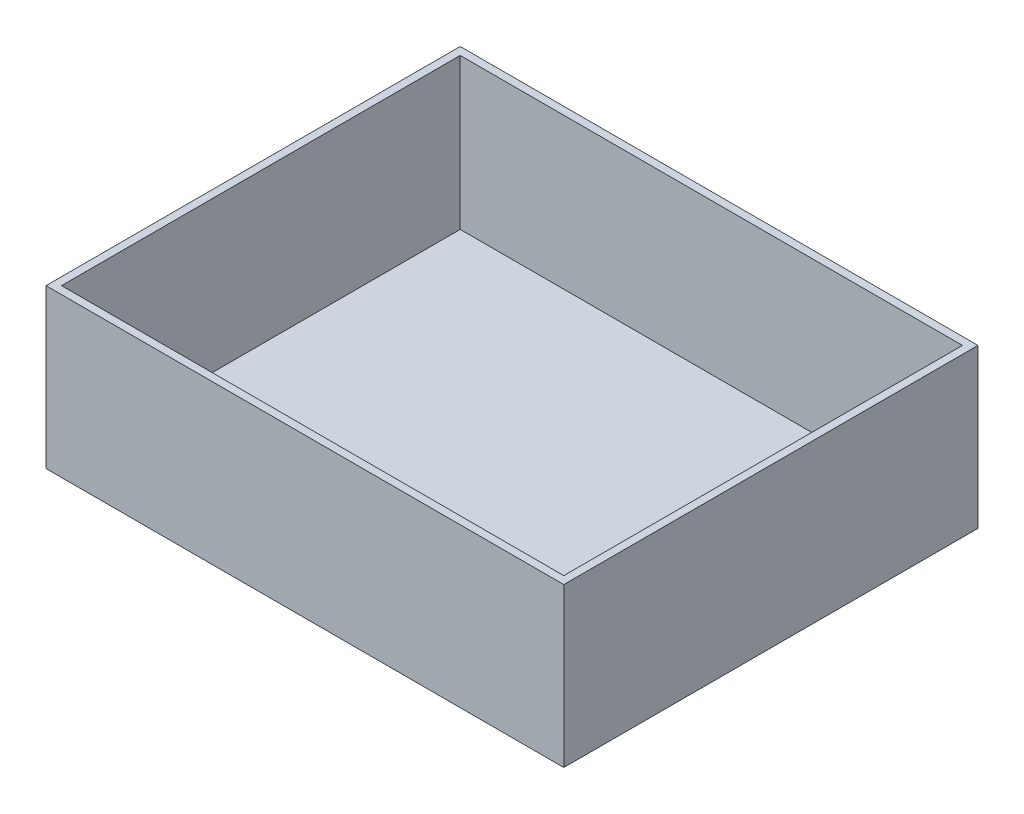
ISO-10303-21;
HEADER;
FILE_DESCRIPTION(('STEP AP214'),'2;1');
FILE_NAME('part.step','',(''),(''),'','','');
FILE_SCHEMA(('AUTOMOTIVE_DESIGN { 1 0 10303 214 1 1 1 1 }'));
ENDSEC;
DATA;
#1=APPLICATION_CONTEXT('core data for automotive mechanical design processes');
#2=APPLICATION_PROTOCOL_DEFINITION('international standard','automotive_design',2000,#1);
#3=PRODUCT_CONTEXT('',#1,'mechanical');
#4=PRODUCT('Part','Part','',(#3));
#5=PRODUCT_RELATED_PRODUCT_CATEGORY('part','',(#4));
#6=PRODUCT_DEFINITION_FORMATION('','',#4);
#7=PRODUCT_DEFINITION_CONTEXT('part definition',#1,'design');
#8=PRODUCT_DEFINITION('design','',#6,#7);
#9=PRODUCT_DEFINITION_SHAPE('','',#8);
#10=(LENGTH_UNIT() NAMED_UNIT(*) SI_UNIT(.MILLI.,.METRE.));
#11=(NAMED_UNIT(*) PLANE_ANGLE_UNIT() SI_UNIT($,.RADIAN.));
#12=(NAMED_UNIT(*) SI_UNIT($,.STERADIAN.) SOLID_ANGLE_UNIT());
#13=UNCERTAINTY_MEASURE_WITH_UNIT(LENGTH_MEASURE(1.E-05),#10,'distance_accuracy_value','');
#14=(GEOMETRIC_REPRESENTATION_CONTEXT(3) GLOBAL_UNCERTAINTY_ASSIGNED_CONTEXT((#13)) GLOBAL_UNIT_ASSIGNED_CONTEXT((#10,
#11,#12)) REPRESENTATION_CONTEXT('',''));
#15=CARTESIAN_POINT('',(0.,0.,0.));
#16=DIRECTION('',(0.,0.,1.));
#17=DIRECTION('',(1.,0.,0.));
#18=AXIS2_PLACEMENT_3D('',#15,#16,#17);
#19=CARTESIAN_POINT('',(250.,153.,-200.));
#20=DIRECTION('',(-1.,0.,0.));
#21=DIRECTION('',(0.,0.,1.));
#22=AXIS2_PLACEMENT_3D('',#19,#20,#21);
#23=PLANE('',#22);
#24=DIRECTION('',(0.,0.,-1.));
#25=VECTOR('',#24,1.);
#26=CARTESIAN_POINT('',(250.,0.,-200.));
#27=LINE('',#26,#25);
#28=CARTESIAN_POINT('',(250.,0.,200.));
#29=VERTEX_POINT('',#28);
#30=CARTESIAN_POINT('',(250.,0.,-200.));
#31=VERTEX_POINT('',#30);
#32=EDGE_CURVE('E167',#29,#31,#27,.T.);
#33=ORIENTED_EDGE('',*,*,#32,.T.);
#34=DIRECTION('',(0.,-1.,0.));
#35=VECTOR('',#34,1.);
#36=CARTESIAN_POINT('',(250.,153.,-200.));
#37=LINE('',#36,#35);
#38=CARTESIAN_POINT('',(250.,153.,-200.));
#39=VERTEX_POINT('',#38);
#40=EDGE_CURVE('E11',#39,#31,#37,.T.);
#41=ORIENTED_EDGE('',*,*,#40,.F.);
#42=DIRECTION('',(0.,0.,-1.));
#43=VECTOR('',#42,1.);
#44=CARTESIAN_POINT('',(250.,153.,-200.));
#45=LINE('',#44,#43);
#46=CARTESIAN_POINT('',(250.,153.,200.));
#47=VERTEX_POINT('',#46);
#48=EDGE_CURVE('E156',#47,#39,#45,.T.);
#49=ORIENTED_EDGE('',*,*,#48,.F.);
#50=DIRECTION('',(0.,-1.,0.));
#51=VECTOR('',#50,1.);
#52=CARTESIAN_POINT('',(250.,153.,200.));
#53=LINE('',#52,#51);
#54=EDGE_CURVE('E166',#47,#29,#53,.T.);
#55=ORIENTED_EDGE('',*,*,#54,.T.);
#56=EDGE_LOOP('',(#33,#41,#49,#55));
#57=FACE_BOUND('',#56,.T.);
#58=ADVANCED_FACE('F39',(#57),#23,.F.);
#59=CARTESIAN_POINT('',(-250.,153.,-200.));
#60=DIRECTION('',(0.,0.,1.));
#61=DIRECTION('',(1.,0.,0.));
#62=AXIS2_PLACEMENT_3D('',#59,#60,#61);
#63=PLANE('',#62);
#64=DIRECTION('',(-1.,0.,0.));
#65=VECTOR('',#64,1.);
#66=CARTESIAN_POINT('',(-250.,0.,-200.));
#67=LINE('',#66,#65);
#68=CARTESIAN_POINT('',(-250.,0.,-200.));
#69=VERTEX_POINT('',#68);
#70=EDGE_CURVE('E171',#31,#69,#67,.T.);
#71=ORIENTED_EDGE('',*,*,#70,.T.);
#72=DIRECTION('',(0.,-1.,0.));
#73=VECTOR('',#72,1.);
#74=CARTESIAN_POINT('',(-250.,153.,-200.));
#75=LINE('',#74,#73);
#76=CARTESIAN_POINT('',(-250.,153.,-200.));
#77=VERTEX_POINT('',#76);
#78=EDGE_CURVE('E47',#77,#69,#75,.T.);
#79=ORIENTED_EDGE('',*,*,#78,.F.);
#80=DIRECTION('',(-1.,0.,0.));
#81=VECTOR('',#80,1.);
#82=CARTESIAN_POINT('',(-250.,153.,-200.));
#83=LINE('',#82,#81);
#84=EDGE_CURVE('E91',#39,#77,#83,.T.);
#85=ORIENTED_EDGE('',*,*,#84,.F.);
#86=ORIENTED_EDGE('',*,*,#40,.T.);
#87=EDGE_LOOP('',(#71,#79,#85,#86));
#88=FACE_BOUND('',#87,.T.);
#89=ADVANCED_FACE('F206',(#88),#63,.F.);
#90=CARTESIAN_POINT('',(-250.,153.,-200.));
#91=DIRECTION('',(1.,0.,0.));
#92=DIRECTION('',(0.,0.,-1.));
#93=AXIS2_PLACEMENT_3D('',#90,#91,#92);
#94=PLANE('',#93);
#95=DIRECTION('',(0.,0.,1.));
#96=VECTOR('',#95,1.);
#97=CARTESIAN_POINT('',(-250.,0.,-200.));
#98=LINE('',#97,#96);
#99=CARTESIAN_POINT('',(-250.,0.,200.));
#100=VERTEX_POINT('',#99);
#101=EDGE_CURVE('E174',#69,#100,#98,.T.);
#102=ORIENTED_EDGE('',*,*,#101,.T.);
#103=DIRECTION('',(0.,-1.,0.));
#104=VECTOR('',#103,1.);
#105=CARTESIAN_POINT('',(-250.,153.,200.));
#106=LINE('',#105,#104);
#107=CARTESIAN_POINT('',(-250.,153.,200.));
#108=VERTEX_POINT('',#107);
#109=EDGE_CURVE('E181',#108,#100,#106,.T.);
#110=ORIENTED_EDGE('',*,*,#109,.F.);
#111=DIRECTION('',(0.,0.,1.));
#112=VECTOR('',#111,1.);
#113=CARTESIAN_POINT('',(-250.,153.,-200.));
#114=LINE('',#113,#112);
#115=EDGE_CURVE('E161',#77,#108,#114,.T.);
#116=ORIENTED_EDGE('',*,*,#115,.F.);
#117=ORIENTED_EDGE('',*,*,#78,.T.);
#118=EDGE_LOOP('',(#102,#110,#116,#117));
#119=FACE_BOUND('',#118,.T.);
#120=ADVANCED_FACE('F188',(#119),#94,.F.);
#121=CARTESIAN_POINT('',(-250.,153.,200.));
#122=DIRECTION('',(0.,0.,-1.));
#123=DIRECTION('',(-1.,0.,0.));
#124=AXIS2_PLACEMENT_3D('',#121,#122,#123);
#125=PLANE('',#124);
#126=DIRECTION('',(1.,0.,0.));
#127=VECTOR('',#126,1.);
#128=CARTESIAN_POINT('',(-250.,0.,200.));
#129=LINE('',#128,#127);
#130=EDGE_CURVE('E84',#100,#29,#129,.T.);
#131=ORIENTED_EDGE('',*,*,#130,.T.);
#132=ORIENTED_EDGE('',*,*,#54,.F.);
#133=DIRECTION('',(1.,0.,0.));
#134=VECTOR('',#133,1.);
#135=CARTESIAN_POINT('',(-250.,153.,200.));
#136=LINE('',#135,#134);
#137=EDGE_CURVE('E63',#108,#47,#136,.T.);
#138=ORIENTED_EDGE('',*,*,#137,.F.);
#139=ORIENTED_EDGE('',*,*,#109,.T.);
#140=EDGE_LOOP('',(#131,#132,#138,#139));
#141=FACE_BOUND('',#140,.T.);
#142=ADVANCED_FACE('F196',(#141),#125,.F.);
#143=CARTESIAN_POINT('',(0.,153.,0.));
#144=DIRECTION('',(0.,1.,0.));
#145=DIRECTION('',(0.,0.,1.));
#146=AXIS2_PLACEMENT_3D('',#143,#144,#145);
#147=PLANE('',#146);
#148=DIRECTION('',(0.,0.,-1.));
#149=VECTOR('',#148,1.);
#150=CARTESIAN_POINT('',(242.5,153.,-200.));
#151=LINE('',#150,#149);
#152=CARTESIAN_POINT('',(242.5,153.,192.5));
#153=VERTEX_POINT('',#152);
#154=CARTESIAN_POINT('',(242.5,153.,-192.5));
#155=VERTEX_POINT('',#154);
#156=EDGE_CURVE('E140',#153,#155,#151,.T.);
#157=ORIENTED_EDGE('',*,*,#156,.F.);
#158=DIRECTION('',(1.,0.,0.));
#159=VECTOR('',#158,1.);
#160=CARTESIAN_POINT('',(-250.,153.,192.5));
#161=LINE('',#160,#159);
#162=CARTESIAN_POINT('',(-242.5,153.,192.5));
#163=VERTEX_POINT('',#162);
#164=EDGE_CURVE('E153',#163,#153,#161,.T.);
#165=ORIENTED_EDGE('',*,*,#164,.F.);
#166=DIRECTION('',(0.,0.,1.));
#167=VECTOR('',#166,1.);
#168=CARTESIAN_POINT('',(-242.5,153.,-200.));
#169=LINE('',#168,#167);
#170=CARTESIAN_POINT('',(-242.5,153.,-192.5));
#171=VERTEX_POINT('',#170);
#172=EDGE_CURVE('E150',#171,#163,#169,.T.);
#173=ORIENTED_EDGE('',*,*,#172,.F.);
#174=DIRECTION('',(-1.,0.,0.));
#175=VECTOR('',#174,1.);
#176=CARTESIAN_POINT('',(-250.,153.,-192.5));
#177=LINE('',#176,#175);
#178=EDGE_CURVE('E129',#155,#171,#177,.T.);
#179=ORIENTED_EDGE('',*,*,#178,.F.);
#180=EDGE_LOOP('',(#157,#165,#173,#179));
#181=FACE_BOUND('',#180,.T.);
#182=ORIENTED_EDGE('',*,*,#48,.T.);
#183=ORIENTED_EDGE('',*,*,#84,.T.);
#184=ORIENTED_EDGE('',*,*,#115,.T.);
#185=ORIENTED_EDGE('',*,*,#137,.T.);
#186=EDGE_LOOP('',(#182,#183,#184,#185));
#187=FACE_BOUND('',#186,.T.);
#188=ADVANCED_FACE('F198',(#181,#187),#147,.T.);
#189=CARTESIAN_POINT('',(0.,0.,0.));
#190=DIRECTION('',(0.,1.,0.));
#191=DIRECTION('',(0.,0.,1.));
#192=AXIS2_PLACEMENT_3D('',#189,#190,#191);
#193=PLANE('',#192);
#194=ORIENTED_EDGE('',*,*,#32,.F.);
#195=ORIENTED_EDGE('',*,*,#130,.F.);
#196=ORIENTED_EDGE('',*,*,#101,.F.);
#197=ORIENTED_EDGE('',*,*,#70,.F.);
#198=EDGE_LOOP('',(#194,#195,#196,#197));
#199=FACE_BOUND('',#198,.T.);
#200=ADVANCED_FACE('F192',(#199),#193,.F.);
#201=CARTESIAN_POINT('',(242.5,153.,-200.));
#202=DIRECTION('',(-1.,0.,0.));
#203=DIRECTION('',(0.,0.,1.));
#204=AXIS2_PLACEMENT_3D('',#201,#202,#203);
#205=PLANE('',#204);
#206=DIRECTION('',(0.,0.,-1.));
#207=VECTOR('',#206,1.);
#208=CARTESIAN_POINT('',(242.5,7.50000000000001,-200.));
#209=LINE('',#208,#207);
#210=CARTESIAN_POINT('',(242.5,7.5,192.5));
#211=VERTEX_POINT('',#210);
#212=CARTESIAN_POINT('',(242.5,7.5,-192.5));
#213=VERTEX_POINT('',#212);
#214=EDGE_CURVE('E119',#211,#213,#209,.T.);
#215=ORIENTED_EDGE('',*,*,#214,.F.);
#216=DIRECTION('',(0.,-1.,0.));
#217=VECTOR('',#216,1.);
#218=CARTESIAN_POINT('',(242.5,153.,192.5));
#219=LINE('',#218,#217);
#220=EDGE_CURVE('E144',#153,#211,#219,.T.);
#221=ORIENTED_EDGE('',*,*,#220,.F.);
#222=ORIENTED_EDGE('',*,*,#156,.T.);
#223=DIRECTION('',(0.,-1.,0.));
#224=VECTOR('',#223,1.);
#225=CARTESIAN_POINT('',(242.5,153.,-192.5));
#226=LINE('',#225,#224);
#227=EDGE_CURVE('E133',#155,#213,#226,.T.);
#228=ORIENTED_EDGE('',*,*,#227,.T.);
#229=EDGE_LOOP('',(#215,#221,#222,#228));
#230=FACE_BOUND('',#229,.T.);
#231=ADVANCED_FACE('F233',(#230),#205,.T.);
#232=CARTESIAN_POINT('',(-250.,153.,-192.5));
#233=DIRECTION('',(0.,0.,1.));
#234=DIRECTION('',(1.,0.,0.));
#235=AXIS2_PLACEMENT_3D('',#232,#233,#234);
#236=PLANE('',#235);
#237=DIRECTION('',(-1.,0.,0.));
#238=VECTOR('',#237,1.);
#239=CARTESIAN_POINT('',(-250.,7.50000000000001,-192.5));
#240=LINE('',#239,#238);
#241=CARTESIAN_POINT('',(-242.5,7.5,-192.5));
#242=VERTEX_POINT('',#241);
#243=EDGE_CURVE('E113',#213,#242,#240,.T.);
#244=ORIENTED_EDGE('',*,*,#243,.F.);
#245=ORIENTED_EDGE('',*,*,#227,.F.);
#246=ORIENTED_EDGE('',*,*,#178,.T.);
#247=DIRECTION('',(0.,-1.,0.));
#248=VECTOR('',#247,1.);
#249=CARTESIAN_POINT('',(-242.5,153.,-192.5));
#250=LINE('',#249,#248);
#251=EDGE_CURVE('E126',#171,#242,#250,.T.);
#252=ORIENTED_EDGE('',*,*,#251,.T.);
#253=EDGE_LOOP('',(#244,#245,#246,#252));
#254=FACE_BOUND('',#253,.T.);
#255=ADVANCED_FACE('F127',(#254),#236,.T.);
#256=CARTESIAN_POINT('',(-242.5,153.,-200.));
#257=DIRECTION('',(1.,0.,0.));
#258=DIRECTION('',(0.,0.,-1.));
#259=AXIS2_PLACEMENT_3D('',#256,#257,#258);
#260=PLANE('',#259);
#261=DIRECTION('',(0.,0.,1.));
#262=VECTOR('',#261,1.);
#263=CARTESIAN_POINT('',(-242.5,7.50000000000001,-200.));
#264=LINE('',#263,#262);
#265=CARTESIAN_POINT('',(-242.5,7.5,192.5));
#266=VERTEX_POINT('',#265);
#267=EDGE_CURVE('E117',#242,#266,#264,.T.);
#268=ORIENTED_EDGE('',*,*,#267,.F.);
#269=ORIENTED_EDGE('',*,*,#251,.F.);
#270=ORIENTED_EDGE('',*,*,#172,.T.);
#271=DIRECTION('',(0.,-1.,0.));
#272=VECTOR('',#271,1.);
#273=CARTESIAN_POINT('',(-242.5,153.,192.5));
#274=LINE('',#273,#272);
#275=EDGE_CURVE('E54',#163,#266,#274,.T.);
#276=ORIENTED_EDGE('',*,*,#275,.T.);
#277=EDGE_LOOP('',(#268,#269,#270,#276));
#278=FACE_BOUND('',#277,.T.);
#279=ADVANCED_FACE('F135',(#278),#260,.T.);
#280=CARTESIAN_POINT('',(-250.,153.,192.5));
#281=DIRECTION('',(0.,0.,-1.));
#282=DIRECTION('',(-1.,0.,0.));
#283=AXIS2_PLACEMENT_3D('',#280,#281,#282);
#284=PLANE('',#283);
#285=DIRECTION('',(1.,0.,0.));
#286=VECTOR('',#285,1.);
#287=CARTESIAN_POINT('',(-250.,7.50000000000001,192.5));
#288=LINE('',#287,#286);
#289=EDGE_CURVE('E137',#266,#211,#288,.T.);
#290=ORIENTED_EDGE('',*,*,#289,.F.);
#291=ORIENTED_EDGE('',*,*,#275,.F.);
#292=ORIENTED_EDGE('',*,*,#164,.T.);
#293=ORIENTED_EDGE('',*,*,#220,.T.);
#294=EDGE_LOOP('',(#290,#291,#292,#293));
#295=FACE_BOUND('',#294,.T.);
#296=ADVANCED_FACE('F263',(#295),#284,.T.);
#297=CARTESIAN_POINT('',(0.,7.5,0.));
#298=DIRECTION('',(0.,1.,0.));
#299=DIRECTION('',(0.,0.,1.));
#300=AXIS2_PLACEMENT_3D('',#297,#298,#299);
#301=PLANE('',#300);
#302=ORIENTED_EDGE('',*,*,#214,.T.);
#303=ORIENTED_EDGE('',*,*,#243,.T.);
#304=ORIENTED_EDGE('',*,*,#267,.T.);
#305=ORIENTED_EDGE('',*,*,#289,.T.);
#306=EDGE_LOOP('',(#302,#303,#304,#305));
#307=FACE_BOUND('',#306,.T.);
#308=ADVANCED_FACE('F115',(#307),#301,.T.);
#309=CLOSED_SHELL('',(#58,#89,#120,#142,#188,#200,#231,#255,#279,#296,#308));
#310=MANIFOLD_SOLID_BREP('B2',#309);
#311=ADVANCED_BREP_SHAPE_REPRESENTATION('',(#18,#310),#14);
#312=SHAPE_DEFINITION_REPRESENTATION(#9,#311);
ENDSEC;
END-ISO-10303-21;
